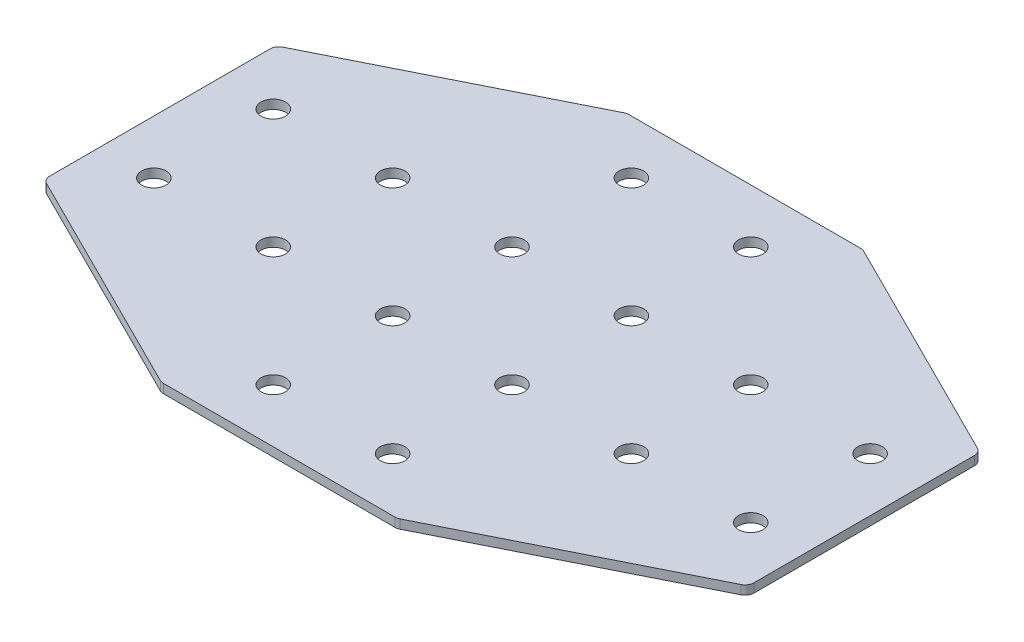
ISO-10303-21;
HEADER;
FILE_DESCRIPTION(('STEP AP214'),'2;1');
FILE_NAME('part.step','',(''),(''),'','','');
FILE_SCHEMA(('AUTOMOTIVE_DESIGN { 1 0 10303 214 1 1 1 1 }'));
ENDSEC;
DATA;
#1=APPLICATION_CONTEXT('core data for automotive mechanical design processes');
#2=APPLICATION_PROTOCOL_DEFINITION('international standard','automotive_design',2000,#1);
#3=PRODUCT_CONTEXT('',#1,'mechanical');
#4=PRODUCT('Part','Part','',(#3));
#5=PRODUCT_RELATED_PRODUCT_CATEGORY('part','',(#4));
#6=PRODUCT_DEFINITION_FORMATION('','',#4);
#7=PRODUCT_DEFINITION_CONTEXT('part definition',#1,'design');
#8=PRODUCT_DEFINITION('design','',#6,#7);
#9=PRODUCT_DEFINITION_SHAPE('','',#8);
#10=(LENGTH_UNIT() NAMED_UNIT(*) SI_UNIT(.MILLI.,.METRE.));
#11=(NAMED_UNIT(*) PLANE_ANGLE_UNIT() SI_UNIT($,.RADIAN.));
#12=(NAMED_UNIT(*) SI_UNIT($,.STERADIAN.) SOLID_ANGLE_UNIT());
#13=UNCERTAINTY_MEASURE_WITH_UNIT(LENGTH_MEASURE(1.E-05),#10,'distance_accuracy_value','');
#14=(GEOMETRIC_REPRESENTATION_CONTEXT(3) GLOBAL_UNCERTAINTY_ASSIGNED_CONTEXT((#13)) GLOBAL_UNIT_ASSIGNED_CONTEXT((#10,
#11,#12)) REPRESENTATION_CONTEXT('',''));
#15=CARTESIAN_POINT('',(0.,0.,0.));
#16=DIRECTION('',(0.,0.,1.));
#17=DIRECTION('',(1.,0.,0.));
#18=AXIS2_PLACEMENT_3D('',#15,#16,#17);
#19=CARTESIAN_POINT('',(-1.23690894298534,0.774709326684388,-1.0374307097436));
#20=DIRECTION('',(0.,-1.,0.));
#21=DIRECTION('',(0.,0.,-1.));
#22=AXIS2_PLACEMENT_3D('',#19,#20,#21);
#23=PLANE('',#22);
#24=CARTESIAN_POINT('',(-21.2369089429853,0.774709326684388,18.9625692902564));
#25=DIRECTION('',(0.,-1.,0.));
#26=DIRECTION('',(0.,0.,1.));
#27=AXIS2_PLACEMENT_3D('',#24,#25,#26);
#28=CIRCLE('',#27,4.1);
#29=CARTESIAN_POINT('',(-21.2369089429853,0.774709326684388,23.0625692902564));
#30=VERTEX_POINT('',#29);
#31=EDGE_CURVE('E140',#30,#30,#28,.T.);
#32=ORIENTED_EDGE('',*,*,#31,.F.);
#33=EDGE_LOOP('',(#32));
#34=FACE_BOUND('',#33,.T.);
#35=CARTESIAN_POINT('',(-21.2369089429853,0.774709326684388,58.9625692902564));
#36=DIRECTION('',(0.,-1.,0.));
#37=DIRECTION('',(0.,0.,1.));
#38=AXIS2_PLACEMENT_3D('',#35,#36,#37);
#39=CIRCLE('',#38,4.1);
#40=CARTESIAN_POINT('',(-21.2369089429853,0.774709326684388,63.0625692902564));
#41=VERTEX_POINT('',#40);
#42=EDGE_CURVE('E243',#41,#41,#39,.T.);
#43=ORIENTED_EDGE('',*,*,#42,.F.);
#44=EDGE_LOOP('',(#43));
#45=FACE_BOUND('',#44,.T.);
#46=CARTESIAN_POINT('',(-61.2369089429853,0.774709326684388,18.9625692902564));
#47=DIRECTION('',(0.,-1.,0.));
#48=DIRECTION('',(0.,0.,1.));
#49=AXIS2_PLACEMENT_3D('',#46,#47,#48);
#50=CIRCLE('',#49,4.1);
#51=CARTESIAN_POINT('',(-61.2369089429853,0.774709326684388,23.0625692902564));
#52=VERTEX_POINT('',#51);
#53=EDGE_CURVE('E237',#52,#52,#50,.T.);
#54=ORIENTED_EDGE('',*,*,#53,.F.);
#55=EDGE_LOOP('',(#54));
#56=FACE_BOUND('',#55,.T.);
#57=CARTESIAN_POINT('',(-101.236908942985,0.774709326684388,18.9625692902564));
#58=DIRECTION('',(0.,-1.,0.));
#59=DIRECTION('',(0.,0.,1.));
#60=AXIS2_PLACEMENT_3D('',#57,#58,#59);
#61=CIRCLE('',#60,4.1);
#62=CARTESIAN_POINT('',(-101.236908942985,0.774709326684388,23.0625692902564));
#63=VERTEX_POINT('',#62);
#64=EDGE_CURVE('E231',#63,#63,#61,.T.);
#65=ORIENTED_EDGE('',*,*,#64,.F.);
#66=EDGE_LOOP('',(#65));
#67=FACE_BOUND('',#66,.T.);
#68=CARTESIAN_POINT('',(18.7630910570146,0.774709326684388,18.9625692902564));
#69=DIRECTION('',(0.,1.,0.));
#70=DIRECTION('',(0.,0.,1.));
#71=AXIS2_PLACEMENT_3D('',#68,#69,#70);
#72=CIRCLE('',#71,4.1);
#73=CARTESIAN_POINT('',(18.7630910570146,0.774709326684388,23.0625692902564));
#74=VERTEX_POINT('',#73);
#75=EDGE_CURVE('E298',#74,#74,#72,.T.);
#76=ORIENTED_EDGE('',*,*,#75,.T.);
#77=EDGE_LOOP('',(#76));
#78=FACE_BOUND('',#77,.T.);
#79=CARTESIAN_POINT('',(18.7630910570147,0.774709326684388,58.9625692902564));
#80=DIRECTION('',(0.,1.,0.));
#81=DIRECTION('',(0.,0.,1.));
#82=AXIS2_PLACEMENT_3D('',#79,#80,#81);
#83=CIRCLE('',#82,4.1);
#84=CARTESIAN_POINT('',(18.7630910570147,0.774709326684388,63.0625692902564));
#85=VERTEX_POINT('',#84);
#86=EDGE_CURVE('E292',#85,#85,#83,.T.);
#87=ORIENTED_EDGE('',*,*,#86,.T.);
#88=EDGE_LOOP('',(#87));
#89=FACE_BOUND('',#88,.T.);
#90=CARTESIAN_POINT('',(58.7630910570147,0.774709326684388,18.9625692902564));
#91=DIRECTION('',(0.,1.,0.));
#92=DIRECTION('',(0.,0.,1.));
#93=AXIS2_PLACEMENT_3D('',#90,#91,#92);
#94=CIRCLE('',#93,4.1);
#95=CARTESIAN_POINT('',(58.7630910570147,0.774709326684388,23.0625692902564));
#96=VERTEX_POINT('',#95);
#97=EDGE_CURVE('E286',#96,#96,#94,.T.);
#98=ORIENTED_EDGE('',*,*,#97,.T.);
#99=EDGE_LOOP('',(#98));
#100=FACE_BOUND('',#99,.T.);
#101=CARTESIAN_POINT('',(98.7630910570147,0.774709326684388,18.9625692902564));
#102=DIRECTION('',(0.,1.,0.));
#103=DIRECTION('',(0.,0.,1.));
#104=AXIS2_PLACEMENT_3D('',#101,#102,#103);
#105=CIRCLE('',#104,4.1);
#106=CARTESIAN_POINT('',(98.7630910570147,0.774709326684388,23.0625692902564));
#107=VERTEX_POINT('',#106);
#108=EDGE_CURVE('E280',#107,#107,#105,.T.);
#109=ORIENTED_EDGE('',*,*,#108,.T.);
#110=EDGE_LOOP('',(#109));
#111=FACE_BOUND('',#110,.T.);
#112=DIRECTION('',(0.,0.,-1.));
#113=VECTOR('',#112,1.);
#114=CARTESIAN_POINT('',(-119.236908942985,0.774709326684388,37.7265013127567));
#115=LINE('',#114,#113);
#116=CARTESIAN_POINT('',(-119.236908942985,0.774709326684388,35.872399346507));
#117=VERTEX_POINT('',#116);
#118=CARTESIAN_POINT('',(-119.236908942985,0.774709326684388,-37.9472607659942));
#119=VERTEX_POINT('',#118);
#120=EDGE_CURVE('E253',#117,#119,#115,.T.);
#121=ORIENTED_EDGE('',*,*,#120,.T.);
#122=CARTESIAN_POINT('',(-116.236908942985,0.774709326684388,-37.9472607659942));
#123=DIRECTION('',(0.,-1.,0.));
#124=DIRECTION('',(0.,0.,1.));
#125=AXIS2_PLACEMENT_3D('',#122,#123,#124);
#126=CIRCLE('',#125,3.);
#127=CARTESIAN_POINT('',(-117.578549729485,0.774709326684388,-40.6305423389939));
#128=VERTEX_POINT('',#127);
#129=EDGE_CURVE('E148',#119,#128,#126,.T.);
#130=ORIENTED_EDGE('',*,*,#129,.T.);
#131=DIRECTION('',(-0.894427190999916,0.,0.447213595499958));
#132=VECTOR('',#131,1.);
#133=CARTESIAN_POINT('',(-40.7647729879859,0.774709326684388,-79.0374307097436));
#134=LINE('',#133,#132);
#135=CARTESIAN_POINT('',(-41.3982098419864,0.774709326684388,-78.7207122827433));
#136=VERTEX_POINT('',#135);
#137=EDGE_CURVE('E158',#136,#128,#134,.T.);
#138=ORIENTED_EDGE('',*,*,#137,.F.);
#139=CARTESIAN_POINT('',(-40.0565690554865,0.774709326684388,-76.0374307097436));
#140=DIRECTION('',(0.,-1.,0.));
#141=DIRECTION('',(0.,0.,1.));
#142=AXIS2_PLACEMENT_3D('',#139,#140,#141);
#143=CIRCLE('',#142,3.);
#144=CARTESIAN_POINT('',(-40.0565690554865,0.774709326684388,-79.0374307097436));
#145=VERTEX_POINT('',#144);
#146=EDGE_CURVE('E168',#136,#145,#143,.T.);
#147=ORIENTED_EDGE('',*,*,#146,.T.);
#148=DIRECTION('',(1.,0.,0.));
#149=VECTOR('',#148,1.);
#150=CARTESIAN_POINT('',(-39.2369089429855,0.774709326684388,-79.0374307097436));
#151=LINE('',#150,#149);
#152=CARTESIAN_POINT('',(37.5827511695159,0.774709326684388,-79.0374307097436));
#153=VERTEX_POINT('',#152);
#154=EDGE_CURVE('E198',#145,#153,#151,.T.);
#155=ORIENTED_EDGE('',*,*,#154,.T.);
#156=CARTESIAN_POINT('',(37.5827511695159,0.774709326684388,-76.0374307097436));
#157=DIRECTION('',(0.,1.,0.));
#158=DIRECTION('',(0.,0.,1.));
#159=AXIS2_PLACEMENT_3D('',#156,#157,#158);
#160=CIRCLE('',#159,3.);
#161=CARTESIAN_POINT('',(38.9243919560157,0.774709326684388,-78.7207122827433));
#162=VERTEX_POINT('',#161);
#163=EDGE_CURVE('E220',#162,#153,#160,.T.);
#164=ORIENTED_EDGE('',*,*,#163,.F.);
#165=DIRECTION('',(0.894427190999916,0.,0.447213595499958));
#166=VECTOR('',#165,1.);
#167=CARTESIAN_POINT('',(38.2909551020152,0.774709326684388,-79.0374307097436));
#168=LINE('',#167,#166);
#169=CARTESIAN_POINT('',(115.104731843514,0.774709326684388,-40.6305423389939));
#170=VERTEX_POINT('',#169);
#171=EDGE_CURVE('E201',#162,#170,#168,.T.);
#172=ORIENTED_EDGE('',*,*,#171,.T.);
#173=CARTESIAN_POINT('',(113.763091057015,0.774709326684388,-37.9472607659942));
#174=DIRECTION('',(0.,1.,0.));
#175=DIRECTION('',(0.,0.,1.));
#176=AXIS2_PLACEMENT_3D('',#173,#174,#175);
#177=CIRCLE('',#176,3.);
#178=CARTESIAN_POINT('',(116.763091057015,0.774709326684388,-37.9472607659942));
#179=VERTEX_POINT('',#178);
#180=EDGE_CURVE('E217',#179,#170,#177,.T.);
#181=ORIENTED_EDGE('',*,*,#180,.F.);
#182=DIRECTION('',(0.,0.,-1.));
#183=VECTOR('',#182,1.);
#184=CARTESIAN_POINT('',(116.763091057015,0.774709326684388,37.7265013127566));
#185=LINE('',#184,#183);
#186=CARTESIAN_POINT('',(116.763091057015,0.774709326684388,35.872399346507));
#187=VERTEX_POINT('',#186);
#188=EDGE_CURVE('E304',#187,#179,#185,.T.);
#189=ORIENTED_EDGE('',*,*,#188,.F.);
#190=CARTESIAN_POINT('',(113.763091057015,0.774709326684388,35.872399346507));
#191=DIRECTION('',(0.,-1.,0.));
#192=DIRECTION('',(0.,0.,-1.));
#193=AXIS2_PLACEMENT_3D('',#190,#191,#192);
#194=CIRCLE('',#193,3.);
#195=CARTESIAN_POINT('',(115.104731843514,0.774709326684388,38.5556809195067));
#196=VERTEX_POINT('',#195);
#197=EDGE_CURVE('E31',#187,#196,#194,.T.);
#198=ORIENTED_EDGE('',*,*,#197,.T.);
#199=DIRECTION('',(0.894427190999916,0.,-0.447213595499958));
#200=VECTOR('',#199,1.);
#201=CARTESIAN_POINT('',(38.2909551020152,0.774709326684388,76.9625692902564));
#202=LINE('',#201,#200);
#203=CARTESIAN_POINT('',(38.9243919560157,0.774709326684388,76.6458508632561));
#204=VERTEX_POINT('',#203);
#205=EDGE_CURVE('E309',#204,#196,#202,.T.);
#206=ORIENTED_EDGE('',*,*,#205,.F.);
#207=CARTESIAN_POINT('',(37.5827511695159,0.774709326684388,73.9625692902564));
#208=DIRECTION('',(0.,-1.,0.));
#209=DIRECTION('',(0.,0.,-1.));
#210=AXIS2_PLACEMENT_3D('',#207,#208,#209);
#211=CIRCLE('',#210,3.);
#212=CARTESIAN_POINT('',(37.5827511695159,0.774709326684388,76.9625692902564));
#213=VERTEX_POINT('',#212);
#214=EDGE_CURVE('E324',#204,#213,#211,.T.);
#215=ORIENTED_EDGE('',*,*,#214,.T.);
#216=DIRECTION('',(1.,0.,0.));
#217=VECTOR('',#216,1.);
#218=CARTESIAN_POINT('',(-39.2369089429855,0.774709326684388,76.9625692902564));
#219=LINE('',#218,#217);
#220=CARTESIAN_POINT('',(-40.0565690554865,0.774709326684388,76.9625692902564));
#221=VERTEX_POINT('',#220);
#222=EDGE_CURVE('E306',#221,#213,#219,.T.);
#223=ORIENTED_EDGE('',*,*,#222,.F.);
#224=CARTESIAN_POINT('',(-40.0565690554865,0.774709326684388,73.9625692902564));
#225=DIRECTION('',(0.,1.,0.));
#226=DIRECTION('',(0.,0.,-1.));
#227=AXIS2_PLACEMENT_3D('',#224,#225,#226);
#228=CIRCLE('',#227,3.);
#229=CARTESIAN_POINT('',(-41.3982098419864,0.774709326684388,76.6458508632561));
#230=VERTEX_POINT('',#229);
#231=EDGE_CURVE('E270',#230,#221,#228,.T.);
#232=ORIENTED_EDGE('',*,*,#231,.F.);
#233=DIRECTION('',(-0.894427190999916,0.,-0.447213595499958));
#234=VECTOR('',#233,1.);
#235=CARTESIAN_POINT('',(-40.7647729879859,0.774709326684388,76.9625692902564));
#236=LINE('',#235,#234);
#237=CARTESIAN_POINT('',(-117.578549729485,0.774709326684388,38.5556809195067));
#238=VERTEX_POINT('',#237);
#239=EDGE_CURVE('E255',#230,#238,#236,.T.);
#240=ORIENTED_EDGE('',*,*,#239,.T.);
#241=CARTESIAN_POINT('',(-116.236908942985,0.774709326684388,35.872399346507));
#242=DIRECTION('',(0.,1.,0.));
#243=DIRECTION('',(0.,0.,-1.));
#244=AXIS2_PLACEMENT_3D('',#241,#242,#243);
#245=CIRCLE('',#244,3.);
#246=EDGE_CURVE('E267',#117,#238,#245,.T.);
#247=ORIENTED_EDGE('',*,*,#246,.F.);
#248=EDGE_LOOP('',(#121,#130,#138,#147,#155,#164,#172,#181,#189,#198,#206,#215,#223,#232,#240,#247));
#249=FACE_BOUND('',#248,.T.);
#250=CARTESIAN_POINT('',(-21.2369089429853,0.774709326684388,-21.0374307097436));
#251=DIRECTION('',(0.,1.,0.));
#252=DIRECTION('',(0.,0.,-1.));
#253=AXIS2_PLACEMENT_3D('',#250,#251,#252);
#254=CIRCLE('',#253,4.1);
#255=CARTESIAN_POINT('',(-21.2369089429853,0.774709326684388,-25.1374307097436));
#256=VERTEX_POINT('',#255);
#257=EDGE_CURVE('E352',#256,#256,#254,.T.);
#258=ORIENTED_EDGE('',*,*,#257,.T.);
#259=EDGE_LOOP('',(#258));
#260=FACE_BOUND('',#259,.T.);
#261=CARTESIAN_POINT('',(-21.2369089429853,0.774709326684388,-61.0374307097436));
#262=DIRECTION('',(0.,1.,0.));
#263=DIRECTION('',(0.,0.,-1.));
#264=AXIS2_PLACEMENT_3D('',#261,#262,#263);
#265=CIRCLE('',#264,4.1);
#266=CARTESIAN_POINT('',(-21.2369089429853,0.774709326684388,-65.1374307097436));
#267=VERTEX_POINT('',#266);
#268=EDGE_CURVE('E356',#267,#267,#265,.T.);
#269=ORIENTED_EDGE('',*,*,#268,.T.);
#270=EDGE_LOOP('',(#269));
#271=FACE_BOUND('',#270,.T.);
#272=CARTESIAN_POINT('',(-61.2369089429853,0.774709326684388,-21.0374307097436));
#273=DIRECTION('',(0.,1.,0.));
#274=DIRECTION('',(0.,0.,-1.));
#275=AXIS2_PLACEMENT_3D('',#272,#273,#274);
#276=CIRCLE('',#275,4.1);
#277=CARTESIAN_POINT('',(-61.2369089429853,0.774709326684388,-25.1374307097436));
#278=VERTEX_POINT('',#277);
#279=EDGE_CURVE('E360',#278,#278,#276,.T.);
#280=ORIENTED_EDGE('',*,*,#279,.T.);
#281=EDGE_LOOP('',(#280));
#282=FACE_BOUND('',#281,.T.);
#283=CARTESIAN_POINT('',(-101.236908942985,0.774709326684388,-21.0374307097436));
#284=DIRECTION('',(0.,1.,0.));
#285=DIRECTION('',(0.,0.,-1.));
#286=AXIS2_PLACEMENT_3D('',#283,#284,#285);
#287=CIRCLE('',#286,4.1);
#288=CARTESIAN_POINT('',(-101.236908942985,0.774709326684388,-25.1374307097436));
#289=VERTEX_POINT('',#288);
#290=EDGE_CURVE('E364',#289,#289,#287,.T.);
#291=ORIENTED_EDGE('',*,*,#290,.T.);
#292=EDGE_LOOP('',(#291));
#293=FACE_BOUND('',#292,.T.);
#294=CARTESIAN_POINT('',(18.7630910570146,0.774709326684388,-21.0374307097436));
#295=DIRECTION('',(0.,-1.,0.));
#296=DIRECTION('',(0.,0.,-1.));
#297=AXIS2_PLACEMENT_3D('',#294,#295,#296);
#298=CIRCLE('',#297,4.1);
#299=CARTESIAN_POINT('',(18.7630910570146,0.774709326684388,-25.1374307097436));
#300=VERTEX_POINT('',#299);
#301=EDGE_CURVE('E192',#300,#300,#298,.T.);
#302=ORIENTED_EDGE('',*,*,#301,.F.);
#303=EDGE_LOOP('',(#302));
#304=FACE_BOUND('',#303,.T.);
#305=CARTESIAN_POINT('',(18.7630910570147,0.774709326684388,-61.0374307097436));
#306=DIRECTION('',(0.,-1.,0.));
#307=DIRECTION('',(0.,0.,-1.));
#308=AXIS2_PLACEMENT_3D('',#305,#306,#307);
#309=CIRCLE('',#308,4.1);
#310=CARTESIAN_POINT('',(18.7630910570147,0.774709326684388,-65.1374307097436));
#311=VERTEX_POINT('',#310);
#312=EDGE_CURVE('E186',#311,#311,#309,.T.);
#313=ORIENTED_EDGE('',*,*,#312,.F.);
#314=EDGE_LOOP('',(#313));
#315=FACE_BOUND('',#314,.T.);
#316=CARTESIAN_POINT('',(58.7630910570147,0.774709326684388,-21.0374307097436));
#317=DIRECTION('',(0.,-1.,0.));
#318=DIRECTION('',(0.,0.,-1.));
#319=AXIS2_PLACEMENT_3D('',#316,#317,#318);
#320=CIRCLE('',#319,4.1);
#321=CARTESIAN_POINT('',(58.7630910570147,0.774709326684388,-25.1374307097436));
#322=VERTEX_POINT('',#321);
#323=EDGE_CURVE('E180',#322,#322,#320,.T.);
#324=ORIENTED_EDGE('',*,*,#323,.F.);
#325=EDGE_LOOP('',(#324));
#326=FACE_BOUND('',#325,.T.);
#327=CARTESIAN_POINT('',(98.7630910570147,0.774709326684388,-21.0374307097436));
#328=DIRECTION('',(0.,-1.,0.));
#329=DIRECTION('',(0.,0.,-1.));
#330=AXIS2_PLACEMENT_3D('',#327,#328,#329);
#331=CIRCLE('',#330,4.1);
#332=CARTESIAN_POINT('',(98.7630910570147,0.774709326684388,-25.1374307097436));
#333=VERTEX_POINT('',#332);
#334=EDGE_CURVE('E174',#333,#333,#331,.T.);
#335=ORIENTED_EDGE('',*,*,#334,.F.);
#336=EDGE_LOOP('',(#335));
#337=FACE_BOUND('',#336,.T.);
#338=ADVANCED_FACE('F16',(#34,#45,#56,#67,#78,#89,#100,#111,#249,#260,#271,#282,#293,#304,#315,
#326,#337),#23,.T.);
#339=CARTESIAN_POINT('',(116.763091057015,0.774709326684388,37.7265013127566));
#340=DIRECTION('',(1.,0.,0.));
#341=DIRECTION('',(0.,0.,-1.));
#342=AXIS2_PLACEMENT_3D('',#339,#340,#341);
#343=PLANE('',#342);
#344=ORIENTED_EDGE('',*,*,#188,.T.);
#345=DIRECTION('',(0.,1.,0.));
#346=VECTOR('',#345,1.);
#347=CARTESIAN_POINT('',(116.763091057015,0.774709326684388,-37.9472607659942));
#348=LINE('',#347,#346);
#349=CARTESIAN_POINT('',(116.763091057015,3.77470932668439,-37.9472607659942));
#350=VERTEX_POINT('',#349);
#351=EDGE_CURVE('E227',#350,#179,#348,.F.);
#352=ORIENTED_EDGE('',*,*,#351,.F.);
#353=DIRECTION('',(0.,0.,-1.));
#354=VECTOR('',#353,1.);
#355=CARTESIAN_POINT('',(116.763091057015,3.77470932668439,37.7265013127566));
#356=LINE('',#355,#354);
#357=CARTESIAN_POINT('',(116.763091057015,3.77470932668439,35.872399346507));
#358=VERTEX_POINT('',#357);
#359=EDGE_CURVE('E301',#358,#350,#356,.T.);
#360=ORIENTED_EDGE('',*,*,#359,.F.);
#361=DIRECTION('',(0.,1.,0.));
#362=VECTOR('',#361,1.);
#363=CARTESIAN_POINT('',(116.763091057015,0.774709326684388,35.872399346507));
#364=LINE('',#363,#362);
#365=EDGE_CURVE('E10',#358,#187,#364,.F.);
#366=ORIENTED_EDGE('',*,*,#365,.T.);
#367=EDGE_LOOP('',(#344,#352,#360,#366));
#368=FACE_BOUND('',#367,.T.);
#369=ADVANCED_FACE('F346',(#368),#343,.T.);
#370=CARTESIAN_POINT('',(-1.23690894298534,3.77470932668439,-1.0374307097436));
#371=DIRECTION('',(0.,-1.,0.));
#372=DIRECTION('',(0.,0.,-1.));
#373=AXIS2_PLACEMENT_3D('',#370,#371,#372);
#374=PLANE('',#373);
#375=CARTESIAN_POINT('',(-21.2369089429853,3.77470932668439,18.9625692902564));
#376=DIRECTION('',(0.,-1.,0.));
#377=DIRECTION('',(0.,0.,1.));
#378=AXIS2_PLACEMENT_3D('',#375,#376,#377);
#379=CIRCLE('',#378,4.1);
#380=CARTESIAN_POINT('',(-21.2369089429853,3.77470932668439,23.0625692902564));
#381=VERTEX_POINT('',#380);
#382=EDGE_CURVE('E246',#381,#381,#379,.T.);
#383=ORIENTED_EDGE('',*,*,#382,.T.);
#384=EDGE_LOOP('',(#383));
#385=FACE_BOUND('',#384,.T.);
#386=CARTESIAN_POINT('',(-21.2369089429853,3.77470932668439,58.9625692902564));
#387=DIRECTION('',(0.,-1.,0.));
#388=DIRECTION('',(0.,0.,1.));
#389=AXIS2_PLACEMENT_3D('',#386,#387,#388);
#390=CIRCLE('',#389,4.1);
#391=CARTESIAN_POINT('',(-21.2369089429853,3.77470932668439,63.0625692902564));
#392=VERTEX_POINT('',#391);
#393=EDGE_CURVE('E240',#392,#392,#390,.T.);
#394=ORIENTED_EDGE('',*,*,#393,.T.);
#395=EDGE_LOOP('',(#394));
#396=FACE_BOUND('',#395,.T.);
#397=CARTESIAN_POINT('',(-61.2369089429853,3.77470932668439,18.9625692902564));
#398=DIRECTION('',(0.,-1.,0.));
#399=DIRECTION('',(0.,0.,1.));
#400=AXIS2_PLACEMENT_3D('',#397,#398,#399);
#401=CIRCLE('',#400,4.1);
#402=CARTESIAN_POINT('',(-61.2369089429853,3.77470932668439,23.0625692902564));
#403=VERTEX_POINT('',#402);
#404=EDGE_CURVE('E234',#403,#403,#401,.T.);
#405=ORIENTED_EDGE('',*,*,#404,.T.);
#406=EDGE_LOOP('',(#405));
#407=FACE_BOUND('',#406,.T.);
#408=CARTESIAN_POINT('',(-101.236908942985,3.77470932668439,18.9625692902564));
#409=DIRECTION('',(0.,-1.,0.));
#410=DIRECTION('',(0.,0.,1.));
#411=AXIS2_PLACEMENT_3D('',#408,#409,#410);
#412=CIRCLE('',#411,4.1);
#413=CARTESIAN_POINT('',(-101.236908942985,3.77470932668439,23.0625692902564));
#414=VERTEX_POINT('',#413);
#415=EDGE_CURVE('E230',#414,#414,#412,.T.);
#416=ORIENTED_EDGE('',*,*,#415,.T.);
#417=EDGE_LOOP('',(#416));
#418=FACE_BOUND('',#417,.T.);
#419=CARTESIAN_POINT('',(18.7630910570146,3.77470932668439,18.9625692902564));
#420=DIRECTION('',(0.,1.,0.));
#421=DIRECTION('',(0.,0.,1.));
#422=AXIS2_PLACEMENT_3D('',#419,#420,#421);
#423=CIRCLE('',#422,4.1);
#424=CARTESIAN_POINT('',(18.7630910570146,3.77470932668439,23.0625692902564));
#425=VERTEX_POINT('',#424);
#426=EDGE_CURVE('E295',#425,#425,#423,.T.);
#427=ORIENTED_EDGE('',*,*,#426,.F.);
#428=EDGE_LOOP('',(#427));
#429=FACE_BOUND('',#428,.T.);
#430=CARTESIAN_POINT('',(18.7630910570147,3.77470932668439,58.9625692902564));
#431=DIRECTION('',(0.,1.,0.));
#432=DIRECTION('',(0.,0.,1.));
#433=AXIS2_PLACEMENT_3D('',#430,#431,#432);
#434=CIRCLE('',#433,4.1);
#435=CARTESIAN_POINT('',(18.7630910570147,3.77470932668439,63.0625692902564));
#436=VERTEX_POINT('',#435);
#437=EDGE_CURVE('E289',#436,#436,#434,.T.);
#438=ORIENTED_EDGE('',*,*,#437,.F.);
#439=EDGE_LOOP('',(#438));
#440=FACE_BOUND('',#439,.T.);
#441=CARTESIAN_POINT('',(58.7630910570147,3.77470932668439,18.9625692902564));
#442=DIRECTION('',(0.,1.,0.));
#443=DIRECTION('',(0.,0.,1.));
#444=AXIS2_PLACEMENT_3D('',#441,#442,#443);
#445=CIRCLE('',#444,4.1);
#446=CARTESIAN_POINT('',(58.7630910570147,3.77470932668439,23.0625692902564));
#447=VERTEX_POINT('',#446);
#448=EDGE_CURVE('E283',#447,#447,#445,.T.);
#449=ORIENTED_EDGE('',*,*,#448,.F.);
#450=EDGE_LOOP('',(#449));
#451=FACE_BOUND('',#450,.T.);
#452=CARTESIAN_POINT('',(98.7630910570147,3.77470932668439,18.9625692902564));
#453=DIRECTION('',(0.,1.,0.));
#454=DIRECTION('',(0.,0.,1.));
#455=AXIS2_PLACEMENT_3D('',#452,#453,#454);
#456=CIRCLE('',#455,4.1);
#457=CARTESIAN_POINT('',(98.7630910570147,3.77470932668439,23.0625692902564));
#458=VERTEX_POINT('',#457);
#459=EDGE_CURVE('E279',#458,#458,#456,.T.);
#460=ORIENTED_EDGE('',*,*,#459,.F.);
#461=EDGE_LOOP('',(#460));
#462=FACE_BOUND('',#461,.T.);
#463=ORIENTED_EDGE('',*,*,#359,.T.);
#464=CARTESIAN_POINT('',(113.763091057015,3.77470932668439,-37.9472607659942));
#465=DIRECTION('',(0.,1.,0.));
#466=DIRECTION('',(0.,0.,1.));
#467=AXIS2_PLACEMENT_3D('',#464,#465,#466);
#468=CIRCLE('',#467,3.);
#469=CARTESIAN_POINT('',(115.104731843514,3.77470932668439,-40.6305423389939));
#470=VERTEX_POINT('',#469);
#471=EDGE_CURVE('E205',#470,#350,#468,.F.);
#472=ORIENTED_EDGE('',*,*,#471,.F.);
#473=DIRECTION('',(0.894427190999916,0.,0.447213595499958));
#474=VECTOR('',#473,1.);
#475=CARTESIAN_POINT('',(38.2909551020152,3.77470932668439,-79.0374307097436));
#476=LINE('',#475,#474);
#477=CARTESIAN_POINT('',(38.9243919560157,3.77470932668439,-78.7207122827433));
#478=VERTEX_POINT('',#477);
#479=EDGE_CURVE('E202',#478,#470,#476,.T.);
#480=ORIENTED_EDGE('',*,*,#479,.F.);
#481=CARTESIAN_POINT('',(37.5827511695159,3.77470932668439,-76.0374307097436));
#482=DIRECTION('',(0.,1.,0.));
#483=DIRECTION('',(0.,0.,1.));
#484=AXIS2_PLACEMENT_3D('',#481,#482,#483);
#485=CIRCLE('',#484,3.);
#486=CARTESIAN_POINT('',(37.5827511695159,3.77470932668439,-79.0374307097436));
#487=VERTEX_POINT('',#486);
#488=EDGE_CURVE('E212',#487,#478,#485,.F.);
#489=ORIENTED_EDGE('',*,*,#488,.F.);
#490=DIRECTION('',(1.,0.,0.));
#491=VECTOR('',#490,1.);
#492=CARTESIAN_POINT('',(-39.2369089429855,3.77470932668439,-79.0374307097436));
#493=LINE('',#492,#491);
#494=CARTESIAN_POINT('',(-40.0565690554865,3.77470932668439,-79.0374307097436));
#495=VERTEX_POINT('',#494);
#496=EDGE_CURVE('E195',#495,#487,#493,.T.);
#497=ORIENTED_EDGE('',*,*,#496,.F.);
#498=CARTESIAN_POINT('',(-40.0565690554865,3.77470932668439,-76.0374307097436));
#499=DIRECTION('',(0.,-1.,0.));
#500=DIRECTION('',(0.,0.,1.));
#501=AXIS2_PLACEMENT_3D('',#498,#499,#500);
#502=CIRCLE('',#501,3.);
#503=CARTESIAN_POINT('',(-41.3982098419864,3.77470932668439,-78.7207122827433));
#504=VERTEX_POINT('',#503);
#505=EDGE_CURVE('E157',#495,#504,#502,.F.);
#506=ORIENTED_EDGE('',*,*,#505,.T.);
#507=DIRECTION('',(-0.894427190999916,0.,0.447213595499958));
#508=VECTOR('',#507,1.);
#509=CARTESIAN_POINT('',(-40.7647729879859,3.77470932668439,-79.0374307097436));
#510=LINE('',#509,#508);
#511=CARTESIAN_POINT('',(-117.578549729485,3.77470932668439,-40.6305423389939));
#512=VERTEX_POINT('',#511);
#513=EDGE_CURVE('E156',#504,#512,#510,.T.);
#514=ORIENTED_EDGE('',*,*,#513,.T.);
#515=CARTESIAN_POINT('',(-116.236908942985,3.77470932668439,-37.9472607659942));
#516=DIRECTION('',(0.,-1.,0.));
#517=DIRECTION('',(0.,0.,1.));
#518=AXIS2_PLACEMENT_3D('',#515,#516,#517);
#519=CIRCLE('',#518,3.);
#520=CARTESIAN_POINT('',(-119.236908942985,3.77470932668439,-37.9472607659942));
#521=VERTEX_POINT('',#520);
#522=EDGE_CURVE('E145',#512,#521,#519,.F.);
#523=ORIENTED_EDGE('',*,*,#522,.T.);
#524=DIRECTION('',(0.,0.,-1.));
#525=VECTOR('',#524,1.);
#526=CARTESIAN_POINT('',(-119.236908942985,3.77470932668439,37.7265013127567));
#527=LINE('',#526,#525);
#528=CARTESIAN_POINT('',(-119.236908942985,3.77470932668439,35.872399346507));
#529=VERTEX_POINT('',#528);
#530=EDGE_CURVE('E130',#529,#521,#527,.T.);
#531=ORIENTED_EDGE('',*,*,#530,.F.);
#532=CARTESIAN_POINT('',(-116.236908942985,3.77470932668439,35.872399346507));
#533=DIRECTION('',(0.,1.,0.));
#534=DIRECTION('',(0.,0.,-1.));
#535=AXIS2_PLACEMENT_3D('',#532,#533,#534);
#536=CIRCLE('',#535,3.);
#537=CARTESIAN_POINT('',(-117.578549729485,3.77470932668439,38.5556809195067));
#538=VERTEX_POINT('',#537);
#539=EDGE_CURVE('E257',#538,#529,#536,.F.);
#540=ORIENTED_EDGE('',*,*,#539,.F.);
#541=DIRECTION('',(-0.894427190999916,0.,-0.447213595499958));
#542=VECTOR('',#541,1.);
#543=CARTESIAN_POINT('',(-40.7647729879859,3.77470932668439,76.9625692902564));
#544=LINE('',#543,#542);
#545=CARTESIAN_POINT('',(-41.3982098419864,3.77470932668439,76.6458508632561));
#546=VERTEX_POINT('',#545);
#547=EDGE_CURVE('E139',#546,#538,#544,.T.);
#548=ORIENTED_EDGE('',*,*,#547,.F.);
#549=CARTESIAN_POINT('',(-40.0565690554865,3.77470932668439,73.9625692902564));
#550=DIRECTION('',(0.,1.,0.));
#551=DIRECTION('',(0.,0.,-1.));
#552=AXIS2_PLACEMENT_3D('',#549,#550,#551);
#553=CIRCLE('',#552,3.);
#554=CARTESIAN_POINT('',(-40.0565690554865,3.77470932668439,76.9625692902564));
#555=VERTEX_POINT('',#554);
#556=EDGE_CURVE('E262',#555,#546,#553,.F.);
#557=ORIENTED_EDGE('',*,*,#556,.F.);
#558=DIRECTION('',(1.,0.,0.));
#559=VECTOR('',#558,1.);
#560=CARTESIAN_POINT('',(-39.2369089429855,3.77470932668439,76.9625692902564));
#561=LINE('',#560,#559);
#562=CARTESIAN_POINT('',(37.5827511695159,3.77470932668439,76.9625692902564));
#563=VERTEX_POINT('',#562);
#564=EDGE_CURVE('E313',#555,#563,#561,.T.);
#565=ORIENTED_EDGE('',*,*,#564,.T.);
#566=CARTESIAN_POINT('',(37.5827511695159,3.77470932668439,73.9625692902564));
#567=DIRECTION('',(0.,-1.,0.));
#568=DIRECTION('',(0.,0.,-1.));
#569=AXIS2_PLACEMENT_3D('',#566,#567,#568);
#570=CIRCLE('',#569,3.);
#571=CARTESIAN_POINT('',(38.9243919560157,3.77470932668439,76.6458508632561));
#572=VERTEX_POINT('',#571);
#573=EDGE_CURVE('E318',#563,#572,#570,.F.);
#574=ORIENTED_EDGE('',*,*,#573,.T.);
#575=DIRECTION('',(0.894427190999916,0.,-0.447213595499958));
#576=VECTOR('',#575,1.);
#577=CARTESIAN_POINT('',(38.2909551020152,3.77470932668439,76.9625692902564));
#578=LINE('',#577,#576);
#579=CARTESIAN_POINT('',(115.104731843514,3.77470932668439,38.5556809195067));
#580=VERTEX_POINT('',#579);
#581=EDGE_CURVE('E307',#572,#580,#578,.T.);
#582=ORIENTED_EDGE('',*,*,#581,.T.);
#583=CARTESIAN_POINT('',(113.763091057015,3.77470932668439,35.872399346507));
#584=DIRECTION('',(0.,-1.,0.));
#585=DIRECTION('',(0.,0.,-1.));
#586=AXIS2_PLACEMENT_3D('',#583,#584,#585);
#587=CIRCLE('',#586,3.);
#588=EDGE_CURVE('E311',#580,#358,#587,.F.);
#589=ORIENTED_EDGE('',*,*,#588,.T.);
#590=EDGE_LOOP('',(#463,#472,#480,#489,#497,#506,#514,#523,#531,#540,#548,#557,#565,#574,#582,#589));
#591=FACE_BOUND('',#590,.T.);
#592=CARTESIAN_POINT('',(-21.2369089429853,3.77470932668439,-21.0374307097436));
#593=DIRECTION('',(0.,1.,0.));
#594=DIRECTION('',(0.,0.,-1.));
#595=AXIS2_PLACEMENT_3D('',#592,#593,#594);
#596=CIRCLE('',#595,4.1);
#597=CARTESIAN_POINT('',(-21.2369089429853,3.77470932668439,-25.1374307097436));
#598=VERTEX_POINT('',#597);
#599=EDGE_CURVE('E515',#598,#598,#596,.T.);
#600=ORIENTED_EDGE('',*,*,#599,.F.);
#601=EDGE_LOOP('',(#600));
#602=FACE_BOUND('',#601,.T.);
#603=CARTESIAN_POINT('',(-21.2369089429853,3.77470932668439,-61.0374307097436));
#604=DIRECTION('',(0.,1.,0.));
#605=DIRECTION('',(0.,0.,-1.));
#606=AXIS2_PLACEMENT_3D('',#603,#604,#605);
#607=CIRCLE('',#606,4.1);
#608=CARTESIAN_POINT('',(-21.2369089429853,3.77470932668439,-65.1374307097436));
#609=VERTEX_POINT('',#608);
#610=EDGE_CURVE('E511',#609,#609,#607,.T.);
#611=ORIENTED_EDGE('',*,*,#610,.F.);
#612=EDGE_LOOP('',(#611));
#613=FACE_BOUND('',#612,.T.);
#614=CARTESIAN_POINT('',(-61.2369089429853,3.77470932668439,-21.0374307097436));
#615=DIRECTION('',(0.,1.,0.));
#616=DIRECTION('',(0.,0.,-1.));
#617=AXIS2_PLACEMENT_3D('',#614,#615,#616);
#618=CIRCLE('',#617,4.1);
#619=CARTESIAN_POINT('',(-61.2369089429853,3.77470932668439,-25.1374307097436));
#620=VERTEX_POINT('',#619);
#621=EDGE_CURVE('E507',#620,#620,#618,.T.);
#622=ORIENTED_EDGE('',*,*,#621,.F.);
#623=EDGE_LOOP('',(#622));
#624=FACE_BOUND('',#623,.T.);
#625=CARTESIAN_POINT('',(-101.236908942985,3.77470932668439,-21.0374307097436));
#626=DIRECTION('',(0.,1.,0.));
#627=DIRECTION('',(0.,0.,-1.));
#628=AXIS2_PLACEMENT_3D('',#625,#626,#627);
#629=CIRCLE('',#628,4.1);
#630=CARTESIAN_POINT('',(-101.236908942985,3.77470932668439,-25.1374307097436));
#631=VERTEX_POINT('',#630);
#632=EDGE_CURVE('E504',#631,#631,#629,.T.);
#633=ORIENTED_EDGE('',*,*,#632,.F.);
#634=EDGE_LOOP('',(#633));
#635=FACE_BOUND('',#634,.T.);
#636=CARTESIAN_POINT('',(18.7630910570146,3.77470932668439,-21.0374307097436));
#637=DIRECTION('',(0.,-1.,0.));
#638=DIRECTION('',(0.,0.,-1.));
#639=AXIS2_PLACEMENT_3D('',#636,#637,#638);
#640=CIRCLE('',#639,4.1);
#641=CARTESIAN_POINT('',(18.7630910570146,3.77470932668439,-25.1374307097436));
#642=VERTEX_POINT('',#641);
#643=EDGE_CURVE('E189',#642,#642,#640,.T.);
#644=ORIENTED_EDGE('',*,*,#643,.T.);
#645=EDGE_LOOP('',(#644));
#646=FACE_BOUND('',#645,.T.);
#647=CARTESIAN_POINT('',(18.7630910570147,3.77470932668439,-61.0374307097436));
#648=DIRECTION('',(0.,-1.,0.));
#649=DIRECTION('',(0.,0.,-1.));
#650=AXIS2_PLACEMENT_3D('',#647,#648,#649);
#651=CIRCLE('',#650,4.1);
#652=CARTESIAN_POINT('',(18.7630910570147,3.77470932668439,-65.1374307097436));
#653=VERTEX_POINT('',#652);
#654=EDGE_CURVE('E183',#653,#653,#651,.T.);
#655=ORIENTED_EDGE('',*,*,#654,.T.);
#656=EDGE_LOOP('',(#655));
#657=FACE_BOUND('',#656,.T.);
#658=CARTESIAN_POINT('',(58.7630910570147,3.77470932668439,-21.0374307097436));
#659=DIRECTION('',(0.,-1.,0.));
#660=DIRECTION('',(0.,0.,-1.));
#661=AXIS2_PLACEMENT_3D('',#658,#659,#660);
#662=CIRCLE('',#661,4.1);
#663=CARTESIAN_POINT('',(58.7630910570147,3.77470932668439,-25.1374307097436));
#664=VERTEX_POINT('',#663);
#665=EDGE_CURVE('E177',#664,#664,#662,.T.);
#666=ORIENTED_EDGE('',*,*,#665,.T.);
#667=EDGE_LOOP('',(#666));
#668=FACE_BOUND('',#667,.T.);
#669=CARTESIAN_POINT('',(98.7630910570147,3.77470932668439,-21.0374307097436));
#670=DIRECTION('',(0.,-1.,0.));
#671=DIRECTION('',(0.,0.,-1.));
#672=AXIS2_PLACEMENT_3D('',#669,#670,#671);
#673=CIRCLE('',#672,4.1);
#674=CARTESIAN_POINT('',(98.7630910570147,3.77470932668439,-25.1374307097436));
#675=VERTEX_POINT('',#674);
#676=EDGE_CURVE('E149',#675,#675,#673,.T.);
#677=ORIENTED_EDGE('',*,*,#676,.T.);
#678=EDGE_LOOP('',(#677));
#679=FACE_BOUND('',#678,.T.);
#680=ADVANCED_FACE('F152',(#385,#396,#407,#418,#429,#440,#451,#462,#591,#602,#613,#624,#635,
#646,#657,#668,#679),#374,.F.);
#681=CARTESIAN_POINT('',(-119.236908942985,0.774709326684388,37.7265013127567));
#682=DIRECTION('',(-1.,0.,0.));
#683=DIRECTION('',(0.,0.,-1.));
#684=AXIS2_PLACEMENT_3D('',#681,#682,#683);
#685=PLANE('',#684);
#686=ORIENTED_EDGE('',*,*,#530,.T.);
#687=DIRECTION('',(0.,1.,0.));
#688=VECTOR('',#687,1.);
#689=CARTESIAN_POINT('',(-119.236908942985,0.774709326684388,-37.9472607659942));
#690=LINE('',#689,#688);
#691=EDGE_CURVE('E134',#521,#119,#690,.F.);
#692=ORIENTED_EDGE('',*,*,#691,.T.);
#693=ORIENTED_EDGE('',*,*,#120,.F.);
#694=DIRECTION('',(0.,1.,0.));
#695=VECTOR('',#694,1.);
#696=CARTESIAN_POINT('',(-119.236908942985,0.774709326684388,35.872399346507));
#697=LINE('',#696,#695);
#698=EDGE_CURVE('E136',#529,#117,#697,.F.);
#699=ORIENTED_EDGE('',*,*,#698,.F.);
#700=EDGE_LOOP('',(#686,#692,#693,#699));
#701=FACE_BOUND('',#700,.T.);
#702=ADVANCED_FACE('F132',(#701),#685,.T.);
#703=CARTESIAN_POINT('',(38.2909551020152,0.774709326684388,76.9625692902564));
#704=DIRECTION('',(0.447213595499958,0.,0.894427190999916));
#705=DIRECTION('',(0.894427190999916,0.,-0.447213595499958));
#706=AXIS2_PLACEMENT_3D('',#703,#704,#705);
#707=PLANE('',#706);
#708=ORIENTED_EDGE('',*,*,#581,.F.);
#709=DIRECTION('',(0.,1.,0.));
#710=VECTOR('',#709,1.);
#711=CARTESIAN_POINT('',(38.9243919560157,0.774709326684388,76.6458508632561));
#712=LINE('',#711,#710);
#713=EDGE_CURVE('E24',#572,#204,#712,.F.);
#714=ORIENTED_EDGE('',*,*,#713,.T.);
#715=ORIENTED_EDGE('',*,*,#205,.T.);
#716=DIRECTION('',(0.,1.,0.));
#717=VECTOR('',#716,1.);
#718=CARTESIAN_POINT('',(115.104731843514,0.774709326684388,38.5556809195067));
#719=LINE('',#718,#717);
#720=EDGE_CURVE('E327',#196,#580,#719,.T.);
#721=ORIENTED_EDGE('',*,*,#720,.T.);
#722=EDGE_LOOP('',(#708,#714,#715,#721));
#723=FACE_BOUND('',#722,.T.);
#724=ADVANCED_FACE('F330',(#723),#707,.T.);
#725=CARTESIAN_POINT('',(-39.2369089429855,0.774709326684388,76.9625692902564));
#726=DIRECTION('',(0.,0.,1.));
#727=DIRECTION('',(1.,0.,0.));
#728=AXIS2_PLACEMENT_3D('',#725,#726,#727);
#729=PLANE('',#728);
#730=ORIENTED_EDGE('',*,*,#564,.F.);
#731=DIRECTION('',(0.,1.,0.));
#732=VECTOR('',#731,1.);
#733=CARTESIAN_POINT('',(-40.0565690554865,0.774709326684388,76.9625692902564));
#734=LINE('',#733,#732);
#735=EDGE_CURVE('E264',#221,#555,#734,.T.);
#736=ORIENTED_EDGE('',*,*,#735,.F.);
#737=ORIENTED_EDGE('',*,*,#222,.T.);
#738=DIRECTION('',(0.,1.,0.));
#739=VECTOR('',#738,1.);
#740=CARTESIAN_POINT('',(37.5827511695159,0.774709326684388,76.9625692902564));
#741=LINE('',#740,#739);
#742=EDGE_CURVE('E320',#213,#563,#741,.T.);
#743=ORIENTED_EDGE('',*,*,#742,.T.);
#744=EDGE_LOOP('',(#730,#736,#737,#743));
#745=FACE_BOUND('',#744,.T.);
#746=ADVANCED_FACE('F340',(#745),#729,.T.);
#747=CARTESIAN_POINT('',(37.5827511695159,0.774709326684388,73.9625692902564));
#748=DIRECTION('',(0.,1.,0.));
#749=DIRECTION('',(0.,0.,1.));
#750=AXIS2_PLACEMENT_3D('',#747,#748,#749);
#751=CYLINDRICAL_SURFACE('',#750,3.);
#752=ORIENTED_EDGE('',*,*,#214,.F.);
#753=ORIENTED_EDGE('',*,*,#713,.F.);
#754=ORIENTED_EDGE('',*,*,#573,.F.);
#755=ORIENTED_EDGE('',*,*,#742,.F.);
#756=EDGE_LOOP('',(#752,#753,#754,#755));
#757=FACE_BOUND('',#756,.T.);
#758=ADVANCED_FACE('F338',(#757),#751,.T.);
#759=CARTESIAN_POINT('',(113.763091057015,0.774709326684388,35.872399346507));
#760=DIRECTION('',(0.,1.,0.));
#761=DIRECTION('',(0.,0.,1.));
#762=AXIS2_PLACEMENT_3D('',#759,#760,#761);
#763=CYLINDRICAL_SURFACE('',#762,3.);
#764=ORIENTED_EDGE('',*,*,#197,.F.);
#765=ORIENTED_EDGE('',*,*,#365,.F.);
#766=ORIENTED_EDGE('',*,*,#588,.F.);
#767=ORIENTED_EDGE('',*,*,#720,.F.);
#768=EDGE_LOOP('',(#764,#765,#766,#767));
#769=FACE_BOUND('',#768,.T.);
#770=ADVANCED_FACE('F18',(#769),#763,.T.);
#771=CARTESIAN_POINT('',(18.7630910570146,0.774709326684388,18.9625692902564));
#772=DIRECTION('',(0.,1.,0.));
#773=DIRECTION('',(0.,0.,1.));
#774=AXIS2_PLACEMENT_3D('',#771,#772,#773);
#775=CYLINDRICAL_SURFACE('',#774,4.1);
#776=ORIENTED_EDGE('',*,*,#75,.F.);
#777=EDGE_LOOP('',(#776));
#778=FACE_BOUND('',#777,.T.);
#779=ORIENTED_EDGE('',*,*,#426,.T.);
#780=EDGE_LOOP('',(#779));
#781=FACE_BOUND('',#780,.T.);
#782=ADVANCED_FACE('F399',(#778,#781),#775,.F.);
#783=CARTESIAN_POINT('',(18.7630910570147,0.774709326684388,58.9625692902564));
#784=DIRECTION('',(0.,1.,0.));
#785=DIRECTION('',(0.,0.,1.));
#786=AXIS2_PLACEMENT_3D('',#783,#784,#785);
#787=CYLINDRICAL_SURFACE('',#786,4.1);
#788=ORIENTED_EDGE('',*,*,#86,.F.);
#789=EDGE_LOOP('',(#788));
#790=FACE_BOUND('',#789,.T.);
#791=ORIENTED_EDGE('',*,*,#437,.T.);
#792=EDGE_LOOP('',(#791));
#793=FACE_BOUND('',#792,.T.);
#794=ADVANCED_FACE('F407',(#790,#793),#787,.F.);
#795=CARTESIAN_POINT('',(58.7630910570147,0.774709326684388,18.9625692902564));
#796=DIRECTION('',(0.,1.,0.));
#797=DIRECTION('',(0.,0.,1.));
#798=AXIS2_PLACEMENT_3D('',#795,#796,#797);
#799=CYLINDRICAL_SURFACE('',#798,4.1);
#800=ORIENTED_EDGE('',*,*,#97,.F.);
#801=EDGE_LOOP('',(#800));
#802=FACE_BOUND('',#801,.T.);
#803=ORIENTED_EDGE('',*,*,#448,.T.);
#804=EDGE_LOOP('',(#803));
#805=FACE_BOUND('',#804,.T.);
#806=ADVANCED_FACE('F411',(#802,#805),#799,.F.);
#807=CARTESIAN_POINT('',(98.7630910570147,0.774709326684388,18.9625692902564));
#808=DIRECTION('',(0.,1.,0.));
#809=DIRECTION('',(0.,0.,1.));
#810=AXIS2_PLACEMENT_3D('',#807,#808,#809);
#811=CYLINDRICAL_SURFACE('',#810,4.1);
#812=ORIENTED_EDGE('',*,*,#108,.F.);
#813=EDGE_LOOP('',(#812));
#814=FACE_BOUND('',#813,.T.);
#815=ORIENTED_EDGE('',*,*,#459,.T.);
#816=EDGE_LOOP('',(#815));
#817=FACE_BOUND('',#816,.T.);
#818=ADVANCED_FACE('F415',(#814,#817),#811,.F.);
#819=CARTESIAN_POINT('',(-40.7647729879859,0.774709326684388,76.9625692902564));
#820=DIRECTION('',(-0.447213595499958,0.,0.894427190999916));
#821=DIRECTION('',(-0.894427190999916,0.,-0.447213595499958));
#822=AXIS2_PLACEMENT_3D('',#819,#820,#821);
#823=PLANE('',#822);
#824=ORIENTED_EDGE('',*,*,#547,.T.);
#825=DIRECTION('',(0.,1.,0.));
#826=VECTOR('',#825,1.);
#827=CARTESIAN_POINT('',(-117.578549729485,0.774709326684388,38.5556809195067));
#828=LINE('',#827,#826);
#829=EDGE_CURVE('E273',#238,#538,#828,.T.);
#830=ORIENTED_EDGE('',*,*,#829,.F.);
#831=ORIENTED_EDGE('',*,*,#239,.F.);
#832=DIRECTION('',(0.,1.,0.));
#833=VECTOR('',#832,1.);
#834=CARTESIAN_POINT('',(-41.3982098419864,0.774709326684388,76.6458508632561));
#835=LINE('',#834,#833);
#836=EDGE_CURVE('E276',#546,#230,#835,.F.);
#837=ORIENTED_EDGE('',*,*,#836,.F.);
#838=EDGE_LOOP('',(#824,#830,#831,#837));
#839=FACE_BOUND('',#838,.T.);
#840=ADVANCED_FACE('F419',(#839),#823,.T.);
#841=CARTESIAN_POINT('',(-40.0565690554865,0.774709326684388,73.9625692902564));
#842=DIRECTION('',(0.,1.,0.));
#843=DIRECTION('',(0.,0.,1.));
#844=AXIS2_PLACEMENT_3D('',#841,#842,#843);
#845=CYLINDRICAL_SURFACE('',#844,3.);
#846=ORIENTED_EDGE('',*,*,#231,.T.);
#847=ORIENTED_EDGE('',*,*,#735,.T.);
#848=ORIENTED_EDGE('',*,*,#556,.T.);
#849=ORIENTED_EDGE('',*,*,#836,.T.);
#850=EDGE_LOOP('',(#846,#847,#848,#849));
#851=FACE_BOUND('',#850,.T.);
#852=ADVANCED_FACE('F425',(#851),#845,.T.);
#853=CARTESIAN_POINT('',(-116.236908942985,0.774709326684388,35.872399346507));
#854=DIRECTION('',(0.,1.,0.));
#855=DIRECTION('',(0.,0.,1.));
#856=AXIS2_PLACEMENT_3D('',#853,#854,#855);
#857=CYLINDRICAL_SURFACE('',#856,3.);
#858=ORIENTED_EDGE('',*,*,#246,.T.);
#859=ORIENTED_EDGE('',*,*,#829,.T.);
#860=ORIENTED_EDGE('',*,*,#539,.T.);
#861=ORIENTED_EDGE('',*,*,#698,.T.);
#862=EDGE_LOOP('',(#858,#859,#860,#861));
#863=FACE_BOUND('',#862,.T.);
#864=ADVANCED_FACE('F421',(#863),#857,.T.);
#865=CARTESIAN_POINT('',(-21.2369089429853,0.774709326684388,18.9625692902564));
#866=DIRECTION('',(0.,1.,0.));
#867=DIRECTION('',(0.,0.,1.));
#868=AXIS2_PLACEMENT_3D('',#865,#866,#867);
#869=CYLINDRICAL_SURFACE('',#868,4.1);
#870=ORIENTED_EDGE('',*,*,#31,.T.);
#871=EDGE_LOOP('',(#870));
#872=FACE_BOUND('',#871,.T.);
#873=ORIENTED_EDGE('',*,*,#382,.F.);
#874=EDGE_LOOP('',(#873));
#875=FACE_BOUND('',#874,.T.);
#876=ADVANCED_FACE('F424',(#872,#875),#869,.F.);
#877=CARTESIAN_POINT('',(-21.2369089429853,0.774709326684388,58.9625692902564));
#878=DIRECTION('',(0.,1.,0.));
#879=DIRECTION('',(0.,0.,1.));
#880=AXIS2_PLACEMENT_3D('',#877,#878,#879);
#881=CYLINDRICAL_SURFACE('',#880,4.1);
#882=ORIENTED_EDGE('',*,*,#42,.T.);
#883=EDGE_LOOP('',(#882));
#884=FACE_BOUND('',#883,.T.);
#885=ORIENTED_EDGE('',*,*,#393,.F.);
#886=EDGE_LOOP('',(#885));
#887=FACE_BOUND('',#886,.T.);
#888=ADVANCED_FACE('F435',(#884,#887),#881,.F.);
#889=CARTESIAN_POINT('',(-61.2369089429853,0.774709326684388,18.9625692902564));
#890=DIRECTION('',(0.,1.,0.));
#891=DIRECTION('',(0.,0.,1.));
#892=AXIS2_PLACEMENT_3D('',#889,#890,#891);
#893=CYLINDRICAL_SURFACE('',#892,4.1);
#894=ORIENTED_EDGE('',*,*,#53,.T.);
#895=EDGE_LOOP('',(#894));
#896=FACE_BOUND('',#895,.T.);
#897=ORIENTED_EDGE('',*,*,#404,.F.);
#898=EDGE_LOOP('',(#897));
#899=FACE_BOUND('',#898,.T.);
#900=ADVANCED_FACE('F439',(#896,#899),#893,.F.);
#901=CARTESIAN_POINT('',(-101.236908942985,0.774709326684388,18.9625692902564));
#902=DIRECTION('',(0.,1.,0.));
#903=DIRECTION('',(0.,0.,1.));
#904=AXIS2_PLACEMENT_3D('',#901,#902,#903);
#905=CYLINDRICAL_SURFACE('',#904,4.1);
#906=ORIENTED_EDGE('',*,*,#64,.T.);
#907=EDGE_LOOP('',(#906));
#908=FACE_BOUND('',#907,.T.);
#909=ORIENTED_EDGE('',*,*,#415,.F.);
#910=EDGE_LOOP('',(#909));
#911=FACE_BOUND('',#910,.T.);
#912=ADVANCED_FACE('F443',(#908,#911),#905,.F.);
#913=CARTESIAN_POINT('',(38.2909551020152,0.774709326684388,-79.0374307097436));
#914=DIRECTION('',(0.447213595499958,0.,-0.894427190999916));
#915=DIRECTION('',(0.894427190999916,0.,0.447213595499958));
#916=AXIS2_PLACEMENT_3D('',#913,#914,#915);
#917=PLANE('',#916);
#918=ORIENTED_EDGE('',*,*,#479,.T.);
#919=DIRECTION('',(0.,1.,0.));
#920=VECTOR('',#919,1.);
#921=CARTESIAN_POINT('',(115.104731843514,0.774709326684388,-40.6305423389939));
#922=LINE('',#921,#920);
#923=EDGE_CURVE('E223',#170,#470,#922,.T.);
#924=ORIENTED_EDGE('',*,*,#923,.F.);
#925=ORIENTED_EDGE('',*,*,#171,.F.);
#926=DIRECTION('',(0.,1.,0.));
#927=VECTOR('',#926,1.);
#928=CARTESIAN_POINT('',(38.9243919560157,0.774709326684388,-78.7207122827433));
#929=LINE('',#928,#927);
#930=EDGE_CURVE('E225',#478,#162,#929,.F.);
#931=ORIENTED_EDGE('',*,*,#930,.F.);
#932=EDGE_LOOP('',(#918,#924,#925,#931));
#933=FACE_BOUND('',#932,.T.);
#934=ADVANCED_FACE('F447',(#933),#917,.T.);
#935=CARTESIAN_POINT('',(-39.2369089429855,0.774709326684388,-79.0374307097436));
#936=DIRECTION('',(0.,0.,-1.));
#937=DIRECTION('',(1.,0.,0.));
#938=AXIS2_PLACEMENT_3D('',#935,#936,#937);
#939=PLANE('',#938);
#940=ORIENTED_EDGE('',*,*,#496,.T.);
#941=DIRECTION('',(0.,1.,0.));
#942=VECTOR('',#941,1.);
#943=CARTESIAN_POINT('',(37.5827511695159,0.774709326684388,-79.0374307097436));
#944=LINE('',#943,#942);
#945=EDGE_CURVE('E215',#153,#487,#944,.T.);
#946=ORIENTED_EDGE('',*,*,#945,.F.);
#947=ORIENTED_EDGE('',*,*,#154,.F.);
#948=DIRECTION('',(0.,1.,0.));
#949=VECTOR('',#948,1.);
#950=CARTESIAN_POINT('',(-40.0565690554865,0.774709326684388,-79.0374307097436));
#951=LINE('',#950,#949);
#952=EDGE_CURVE('E160',#145,#495,#951,.T.);
#953=ORIENTED_EDGE('',*,*,#952,.T.);
#954=EDGE_LOOP('',(#940,#946,#947,#953));
#955=FACE_BOUND('',#954,.T.);
#956=ADVANCED_FACE('F457',(#955),#939,.T.);
#957=CARTESIAN_POINT('',(37.5827511695159,0.774709326684388,-76.0374307097436));
#958=DIRECTION('',(0.,1.,0.));
#959=DIRECTION('',(0.,0.,-1.));
#960=AXIS2_PLACEMENT_3D('',#957,#958,#959);
#961=CYLINDRICAL_SURFACE('',#960,3.);
#962=ORIENTED_EDGE('',*,*,#163,.T.);
#963=ORIENTED_EDGE('',*,*,#945,.T.);
#964=ORIENTED_EDGE('',*,*,#488,.T.);
#965=ORIENTED_EDGE('',*,*,#930,.T.);
#966=EDGE_LOOP('',(#962,#963,#964,#965));
#967=FACE_BOUND('',#966,.T.);
#968=ADVANCED_FACE('F453',(#967),#961,.T.);
#969=CARTESIAN_POINT('',(113.763091057015,0.774709326684388,-37.9472607659942));
#970=DIRECTION('',(0.,1.,0.));
#971=DIRECTION('',(0.,0.,-1.));
#972=AXIS2_PLACEMENT_3D('',#969,#970,#971);
#973=CYLINDRICAL_SURFACE('',#972,3.);
#974=ORIENTED_EDGE('',*,*,#180,.T.);
#975=ORIENTED_EDGE('',*,*,#923,.T.);
#976=ORIENTED_EDGE('',*,*,#471,.T.);
#977=ORIENTED_EDGE('',*,*,#351,.T.);
#978=EDGE_LOOP('',(#974,#975,#976,#977));
#979=FACE_BOUND('',#978,.T.);
#980=ADVANCED_FACE('F449',(#979),#973,.T.);
#981=CARTESIAN_POINT('',(18.7630910570146,0.774709326684388,-21.0374307097436));
#982=DIRECTION('',(0.,1.,0.));
#983=DIRECTION('',(0.,0.,-1.));
#984=AXIS2_PLACEMENT_3D('',#981,#982,#983);
#985=CYLINDRICAL_SURFACE('',#984,4.1);
#986=ORIENTED_EDGE('',*,*,#301,.T.);
#987=EDGE_LOOP('',(#986));
#988=FACE_BOUND('',#987,.T.);
#989=ORIENTED_EDGE('',*,*,#643,.F.);
#990=EDGE_LOOP('',(#989));
#991=FACE_BOUND('',#990,.T.);
#992=ADVANCED_FACE('F452',(#988,#991),#985,.F.);
#993=CARTESIAN_POINT('',(18.7630910570147,0.774709326684388,-61.0374307097436));
#994=DIRECTION('',(0.,1.,0.));
#995=DIRECTION('',(0.,0.,-1.));
#996=AXIS2_PLACEMENT_3D('',#993,#994,#995);
#997=CYLINDRICAL_SURFACE('',#996,4.1);
#998=ORIENTED_EDGE('',*,*,#312,.T.);
#999=EDGE_LOOP('',(#998));
#1000=FACE_BOUND('',#999,.T.);
#1001=ORIENTED_EDGE('',*,*,#654,.F.);
#1002=EDGE_LOOP('',(#1001));
#1003=FACE_BOUND('',#1002,.T.);
#1004=ADVANCED_FACE('F467',(#1000,#1003),#997,.F.);
#1005=CARTESIAN_POINT('',(58.7630910570147,0.774709326684388,-21.0374307097436));
#1006=DIRECTION('',(0.,1.,0.));
#1007=DIRECTION('',(0.,0.,-1.));
#1008=AXIS2_PLACEMENT_3D('',#1005,#1006,#1007);
#1009=CYLINDRICAL_SURFACE('',#1008,4.1);
#1010=ORIENTED_EDGE('',*,*,#323,.T.);
#1011=EDGE_LOOP('',(#1010));
#1012=FACE_BOUND('',#1011,.T.);
#1013=ORIENTED_EDGE('',*,*,#665,.F.);
#1014=EDGE_LOOP('',(#1013));
#1015=FACE_BOUND('',#1014,.T.);
#1016=ADVANCED_FACE('F377',(#1012,#1015),#1009,.F.);
#1017=CARTESIAN_POINT('',(98.7630910570147,0.774709326684388,-21.0374307097436));
#1018=DIRECTION('',(0.,1.,0.));
#1019=DIRECTION('',(0.,0.,-1.));
#1020=AXIS2_PLACEMENT_3D('',#1017,#1018,#1019);
#1021=CYLINDRICAL_SURFACE('',#1020,4.1);
#1022=ORIENTED_EDGE('',*,*,#334,.T.);
#1023=EDGE_LOOP('',(#1022));
#1024=FACE_BOUND('',#1023,.T.);
#1025=ORIENTED_EDGE('',*,*,#676,.F.);
#1026=EDGE_LOOP('',(#1025));
#1027=FACE_BOUND('',#1026,.T.);
#1028=ADVANCED_FACE('F373',(#1024,#1027),#1021,.F.);
#1029=CARTESIAN_POINT('',(-40.7647729879859,0.774709326684388,-79.0374307097436));
#1030=DIRECTION('',(-0.447213595499958,0.,-0.894427190999916));
#1031=DIRECTION('',(-0.894427190999916,0.,0.447213595499958));
#1032=AXIS2_PLACEMENT_3D('',#1029,#1030,#1031);
#1033=PLANE('',#1032);
#1034=ORIENTED_EDGE('',*,*,#513,.F.);
#1035=DIRECTION('',(0.,1.,0.));
#1036=VECTOR('',#1035,1.);
#1037=CARTESIAN_POINT('',(-41.3982098419864,0.774709326684388,-78.7207122827433));
#1038=LINE('',#1037,#1036);
#1039=EDGE_CURVE('E150',#504,#136,#1038,.F.);
#1040=ORIENTED_EDGE('',*,*,#1039,.T.);
#1041=ORIENTED_EDGE('',*,*,#137,.T.);
#1042=DIRECTION('',(0.,1.,0.));
#1043=VECTOR('',#1042,1.);
#1044=CARTESIAN_POINT('',(-117.578549729485,0.774709326684388,-40.6305423389939));
#1045=LINE('',#1044,#1043);
#1046=EDGE_CURVE('E171',#128,#512,#1045,.T.);
#1047=ORIENTED_EDGE('',*,*,#1046,.T.);
#1048=EDGE_LOOP('',(#1034,#1040,#1041,#1047));
#1049=FACE_BOUND('',#1048,.T.);
#1050=ADVANCED_FACE('F376',(#1049),#1033,.T.);
#1051=CARTESIAN_POINT('',(-40.0565690554865,0.774709326684388,-76.0374307097436));
#1052=DIRECTION('',(0.,1.,0.));
#1053=DIRECTION('',(0.,0.,-1.));
#1054=AXIS2_PLACEMENT_3D('',#1051,#1052,#1053);
#1055=CYLINDRICAL_SURFACE('',#1054,3.);
#1056=ORIENTED_EDGE('',*,*,#146,.F.);
#1057=ORIENTED_EDGE('',*,*,#1039,.F.);
#1058=ORIENTED_EDGE('',*,*,#505,.F.);
#1059=ORIENTED_EDGE('',*,*,#952,.F.);
#1060=EDGE_LOOP('',(#1056,#1057,#1058,#1059));
#1061=FACE_BOUND('',#1060,.T.);
#1062=ADVANCED_FACE('F478',(#1061),#1055,.T.);
#1063=CARTESIAN_POINT('',(-116.236908942985,0.774709326684388,-37.9472607659942));
#1064=DIRECTION('',(0.,1.,0.));
#1065=DIRECTION('',(0.,0.,-1.));
#1066=AXIS2_PLACEMENT_3D('',#1063,#1064,#1065);
#1067=CYLINDRICAL_SURFACE('',#1066,3.);
#1068=ORIENTED_EDGE('',*,*,#129,.F.);
#1069=ORIENTED_EDGE('',*,*,#691,.F.);
#1070=ORIENTED_EDGE('',*,*,#522,.F.);
#1071=ORIENTED_EDGE('',*,*,#1046,.F.);
#1072=EDGE_LOOP('',(#1068,#1069,#1070,#1071));
#1073=FACE_BOUND('',#1072,.T.);
#1074=ADVANCED_FACE('F144',(#1073),#1067,.T.);
#1075=CARTESIAN_POINT('',(-21.2369089429853,0.774709326684388,-21.0374307097436));
#1076=DIRECTION('',(0.,1.,0.));
#1077=DIRECTION('',(0.,0.,-1.));
#1078=AXIS2_PLACEMENT_3D('',#1075,#1076,#1077);
#1079=CYLINDRICAL_SURFACE('',#1078,4.1);
#1080=ORIENTED_EDGE('',*,*,#257,.F.);
#1081=EDGE_LOOP('',(#1080));
#1082=FACE_BOUND('',#1081,.T.);
#1083=ORIENTED_EDGE('',*,*,#599,.T.);
#1084=EDGE_LOOP('',(#1083));
#1085=FACE_BOUND('',#1084,.T.);
#1086=ADVANCED_FACE('F477',(#1082,#1085),#1079,.F.);
#1087=CARTESIAN_POINT('',(-21.2369089429853,0.774709326684388,-61.0374307097436));
#1088=DIRECTION('',(0.,1.,0.));
#1089=DIRECTION('',(0.,0.,-1.));
#1090=AXIS2_PLACEMENT_3D('',#1087,#1088,#1089);
#1091=CYLINDRICAL_SURFACE('',#1090,4.1);
#1092=ORIENTED_EDGE('',*,*,#268,.F.);
#1093=EDGE_LOOP('',(#1092));
#1094=FACE_BOUND('',#1093,.T.);
#1095=ORIENTED_EDGE('',*,*,#610,.T.);
#1096=EDGE_LOOP('',(#1095));
#1097=FACE_BOUND('',#1096,.T.);
#1098=ADVANCED_FACE('F487',(#1094,#1097),#1091,.F.);
#1099=CARTESIAN_POINT('',(-61.2369089429853,0.774709326684388,-21.0374307097436));
#1100=DIRECTION('',(0.,1.,0.));
#1101=DIRECTION('',(0.,0.,-1.));
#1102=AXIS2_PLACEMENT_3D('',#1099,#1100,#1101);
#1103=CYLINDRICAL_SURFACE('',#1102,4.1);
#1104=ORIENTED_EDGE('',*,*,#279,.F.);
#1105=EDGE_LOOP('',(#1104));
#1106=FACE_BOUND('',#1105,.T.);
#1107=ORIENTED_EDGE('',*,*,#621,.T.);
#1108=EDGE_LOOP('',(#1107));
#1109=FACE_BOUND('',#1108,.T.);
#1110=ADVANCED_FACE('F491',(#1106,#1109),#1103,.F.);
#1111=CARTESIAN_POINT('',(-101.236908942985,0.774709326684388,-21.0374307097436));
#1112=DIRECTION('',(0.,1.,0.));
#1113=DIRECTION('',(0.,0.,-1.));
#1114=AXIS2_PLACEMENT_3D('',#1111,#1112,#1113);
#1115=CYLINDRICAL_SURFACE('',#1114,4.1);
#1116=ORIENTED_EDGE('',*,*,#290,.F.);
#1117=EDGE_LOOP('',(#1116));
#1118=FACE_BOUND('',#1117,.T.);
#1119=ORIENTED_EDGE('',*,*,#632,.T.);
#1120=EDGE_LOOP('',(#1119));
#1121=FACE_BOUND('',#1120,.T.);
#1122=ADVANCED_FACE('F495',(#1118,#1121),#1115,.F.);
#1123=CLOSED_SHELL('',(#338,#369,#680,#702,#724,#746,#758,#770,#782,#794,#806,#818,#840,#852,
#864,#876,#888,#900,#912,#934,#956,#968,#980,#992,#1004,#1016,#1028,#1050,#1062,#1074,#1086,
#1098,#1110,#1122));
#1124=MANIFOLD_SOLID_BREP('B1',#1123);
#1125=ADVANCED_BREP_SHAPE_REPRESENTATION('',(#18,#1124),#14);
#1126=SHAPE_DEFINITION_REPRESENTATION(#9,#1125);
ENDSEC;
END-ISO-10303-21;
